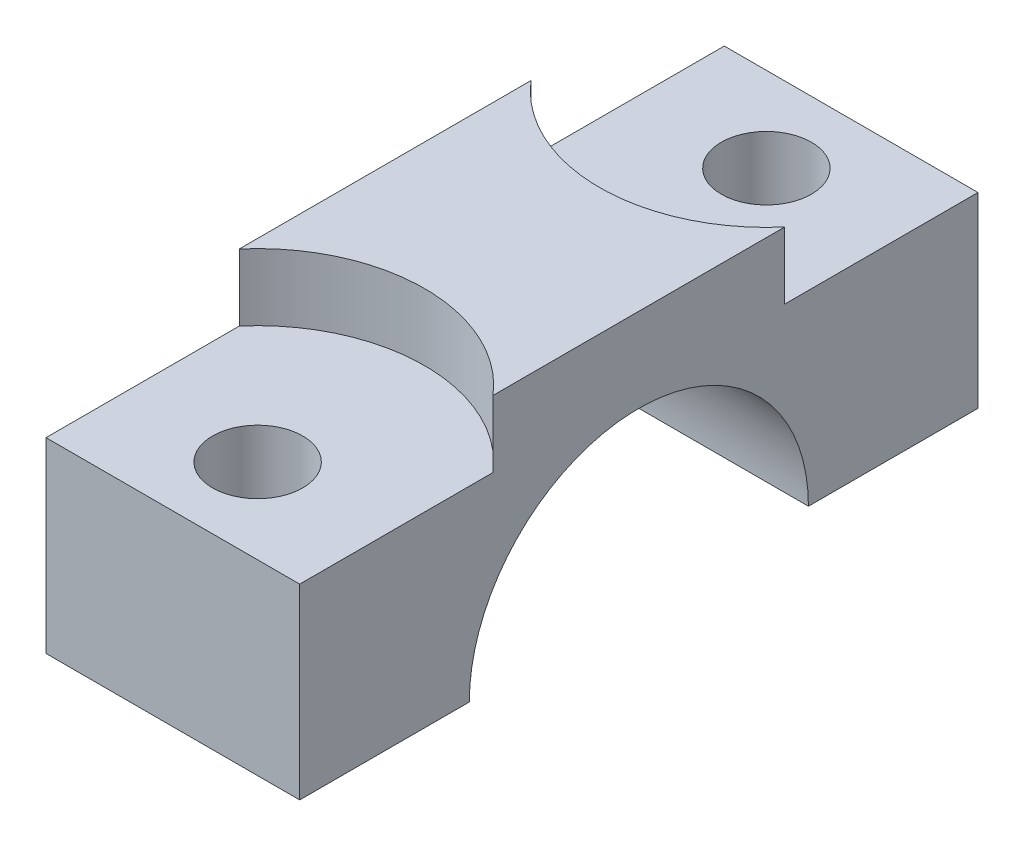
ISO-10303-21;
HEADER;
FILE_DESCRIPTION(('STEP AP214'),'2;1');
FILE_NAME('part.step','',(''),(''),'','','');
FILE_SCHEMA(('AUTOMOTIVE_DESIGN { 1 0 10303 214 1 1 1 1 }'));
ENDSEC;
DATA;
#1=APPLICATION_CONTEXT('core data for automotive mechanical design processes');
#2=APPLICATION_PROTOCOL_DEFINITION('international standard','automotive_design',2000,#1);
#3=PRODUCT_CONTEXT('',#1,'mechanical');
#4=PRODUCT('Part','Part','',(#3));
#5=PRODUCT_RELATED_PRODUCT_CATEGORY('part','',(#4));
#6=PRODUCT_DEFINITION_FORMATION('','',#4);
#7=PRODUCT_DEFINITION_CONTEXT('part definition',#1,'design');
#8=PRODUCT_DEFINITION('design','',#6,#7);
#9=PRODUCT_DEFINITION_SHAPE('','',#8);
#10=(LENGTH_UNIT() NAMED_UNIT(*) SI_UNIT(.MILLI.,.METRE.));
#11=(NAMED_UNIT(*) PLANE_ANGLE_UNIT() SI_UNIT($,.RADIAN.));
#12=(NAMED_UNIT(*) SI_UNIT($,.STERADIAN.) SOLID_ANGLE_UNIT());
#13=UNCERTAINTY_MEASURE_WITH_UNIT(LENGTH_MEASURE(1.E-05),#10,'distance_accuracy_value','');
#14=(GEOMETRIC_REPRESENTATION_CONTEXT(3) GLOBAL_UNCERTAINTY_ASSIGNED_CONTEXT((#13)) GLOBAL_UNIT_ASSIGNED_CONTEXT((#10,
#11,#12)) REPRESENTATION_CONTEXT('',''));
#15=CARTESIAN_POINT('',(0.,0.,0.));
#16=DIRECTION('',(0.,0.,1.));
#17=DIRECTION('',(1.,0.,0.));
#18=AXIS2_PLACEMENT_3D('',#15,#16,#17);
#19=CARTESIAN_POINT('',(9.5,0.,0.));
#20=DIRECTION('',(-1.,0.,0.));
#21=DIRECTION('',(0.,0.,1.));
#22=AXIS2_PLACEMENT_3D('',#19,#20,#21);
#23=CYLINDRICAL_SURFACE('',#22,12.7);
#24=CARTESIAN_POINT('',(-9.5,0.,0.));
#25=DIRECTION('',(1.,0.,0.));
#26=DIRECTION('',(0.,0.,-1.));
#27=AXIS2_PLACEMENT_3D('',#24,#25,#26);
#28=CIRCLE('',#27,12.7);
#29=CARTESIAN_POINT('',(-9.5,0.,-12.7));
#30=VERTEX_POINT('',#29);
#31=CARTESIAN_POINT('',(-9.5,0.,12.7));
#32=VERTEX_POINT('',#31);
#33=EDGE_CURVE('E145',#30,#32,#28,.T.);
#34=ORIENTED_EDGE('',*,*,#33,.F.);
#35=DIRECTION('',(-1.,0.,0.));
#36=VECTOR('',#35,1.);
#37=CARTESIAN_POINT('',(9.5,0.,-12.7));
#38=LINE('',#37,#36);
#39=CARTESIAN_POINT('',(9.5,0.,-12.7));
#40=VERTEX_POINT('',#39);
#41=EDGE_CURVE('E167',#40,#30,#38,.T.);
#42=ORIENTED_EDGE('',*,*,#41,.F.);
#43=CARTESIAN_POINT('',(9.5,0.,0.));
#44=DIRECTION('',(1.,0.,0.));
#45=DIRECTION('',(0.,0.,-1.));
#46=AXIS2_PLACEMENT_3D('',#43,#44,#45);
#47=CIRCLE('',#46,12.7);
#48=CARTESIAN_POINT('',(9.5,0.,12.7));
#49=VERTEX_POINT('',#48);
#50=EDGE_CURVE('E188',#40,#49,#47,.T.);
#51=ORIENTED_EDGE('',*,*,#50,.T.);
#52=DIRECTION('',(-1.,0.,0.));
#53=VECTOR('',#52,1.);
#54=CARTESIAN_POINT('',(9.5,0.,12.7));
#55=LINE('',#54,#53);
#56=EDGE_CURVE('E160',#49,#32,#55,.T.);
#57=ORIENTED_EDGE('',*,*,#56,.T.);
#58=EDGE_LOOP('',(#34,#42,#51,#57));
#59=FACE_BOUND('',#58,.T.);
#60=ADVANCED_FACE('F37',(#59),#23,.F.);
#61=CARTESIAN_POINT('',(9.5,0.,0.));
#62=DIRECTION('',(0.,1.,0.));
#63=DIRECTION('',(0.,0.,1.));
#64=AXIS2_PLACEMENT_3D('',#61,#62,#63);
#65=PLANE('',#64);
#66=CARTESIAN_POINT('',(0.,0.,-19.05));
#67=DIRECTION('',(0.,1.,0.));
#68=DIRECTION('',(0.,0.,1.));
#69=AXIS2_PLACEMENT_3D('',#66,#67,#68);
#70=CIRCLE('',#69,3.375);
#71=CARTESIAN_POINT('',(0.,0.,-15.675));
#72=VERTEX_POINT('',#71);
#73=EDGE_CURVE('E130',#72,#72,#70,.T.);
#74=ORIENTED_EDGE('',*,*,#73,.T.);
#75=EDGE_LOOP('',(#74));
#76=FACE_BOUND('',#75,.T.);
#77=DIRECTION('',(0.,0.,-1.));
#78=VECTOR('',#77,1.);
#79=CARTESIAN_POINT('',(-9.5,0.,0.));
#80=LINE('',#79,#78);
#81=CARTESIAN_POINT('',(-9.5,0.,-25.4));
#82=VERTEX_POINT('',#81);
#83=EDGE_CURVE('E148',#30,#82,#80,.T.);
#84=ORIENTED_EDGE('',*,*,#83,.T.);
#85=DIRECTION('',(-1.,0.,0.));
#86=VECTOR('',#85,1.);
#87=CARTESIAN_POINT('',(9.5,0.,-25.4));
#88=LINE('',#87,#86);
#89=CARTESIAN_POINT('',(9.5,0.,-25.4));
#90=VERTEX_POINT('',#89);
#91=EDGE_CURVE('E164',#90,#82,#88,.T.);
#92=ORIENTED_EDGE('',*,*,#91,.F.);
#93=DIRECTION('',(0.,0.,-1.));
#94=VECTOR('',#93,1.);
#95=CARTESIAN_POINT('',(9.5,0.,0.));
#96=LINE('',#95,#94);
#97=EDGE_CURVE('E141',#40,#90,#96,.T.);
#98=ORIENTED_EDGE('',*,*,#97,.F.);
#99=ORIENTED_EDGE('',*,*,#41,.T.);
#100=EDGE_LOOP('',(#84,#92,#98,#99));
#101=FACE_BOUND('',#100,.T.);
#102=ADVANCED_FACE('F205',(#76,#101),#65,.F.);
#103=CARTESIAN_POINT('',(9.5,0.,-25.4));
#104=DIRECTION('',(0.,0.,1.));
#105=DIRECTION('',(1.,0.,0.));
#106=AXIS2_PLACEMENT_3D('',#103,#104,#105);
#107=PLANE('',#106);
#108=DIRECTION('',(0.,1.,0.));
#109=VECTOR('',#108,1.);
#110=CARTESIAN_POINT('',(-9.5,0.,-25.4));
#111=LINE('',#110,#109);
#112=CARTESIAN_POINT('',(-9.5,14.,-25.4));
#113=VERTEX_POINT('',#112);
#114=EDGE_CURVE('E151',#82,#113,#111,.T.);
#115=ORIENTED_EDGE('',*,*,#114,.T.);
#116=DIRECTION('',(1.,0.,0.));
#117=VECTOR('',#116,1.);
#118=CARTESIAN_POINT('',(9.5,14.,-25.4));
#119=LINE('',#118,#117);
#120=CARTESIAN_POINT('',(9.5,14.,-25.4));
#121=VERTEX_POINT('',#120);
#122=EDGE_CURVE('E129',#113,#121,#119,.T.);
#123=ORIENTED_EDGE('',*,*,#122,.T.);
#124=DIRECTION('',(0.,1.,0.));
#125=VECTOR('',#124,1.);
#126=CARTESIAN_POINT('',(9.5,0.,-25.4));
#127=LINE('',#126,#125);
#128=EDGE_CURVE('E136',#90,#121,#127,.T.);
#129=ORIENTED_EDGE('',*,*,#128,.F.);
#130=ORIENTED_EDGE('',*,*,#91,.T.);
#131=EDGE_LOOP('',(#115,#123,#129,#130));
#132=FACE_BOUND('',#131,.T.);
#133=ADVANCED_FACE('F209',(#132),#107,.F.);
#134=CARTESIAN_POINT('',(9.5,19.,0.));
#135=DIRECTION('',(0.,1.,0.));
#136=DIRECTION('',(0.,0.,1.));
#137=AXIS2_PLACEMENT_3D('',#134,#135,#136);
#138=PLANE('',#137);
#139=CARTESIAN_POINT('',(0.,19.,-19.05));
#140=DIRECTION('',(0.,1.,0.));
#141=DIRECTION('',(0.,0.,1.));
#142=AXIS2_PLACEMENT_3D('',#139,#140,#141);
#143=CIRCLE('',#142,12.5);
#144=CARTESIAN_POINT('',(-9.5,19.,-10.925961595364));
#145=VERTEX_POINT('',#144);
#146=CARTESIAN_POINT('',(9.5,19.,-10.925961595364));
#147=VERTEX_POINT('',#146);
#148=EDGE_CURVE('E111',#145,#147,#143,.T.);
#149=ORIENTED_EDGE('',*,*,#148,.F.);
#150=DIRECTION('',(0.,0.,-1.));
#151=VECTOR('',#150,1.);
#152=CARTESIAN_POINT('',(-9.5,19.,0.));
#153=LINE('',#152,#151);
#154=CARTESIAN_POINT('',(-9.5,19.,10.925961595364));
#155=VERTEX_POINT('',#154);
#156=EDGE_CURVE('E155',#155,#145,#153,.T.);
#157=ORIENTED_EDGE('',*,*,#156,.F.);
#158=CARTESIAN_POINT('',(0.,19.,19.05));
#159=DIRECTION('',(0.,1.,0.));
#160=DIRECTION('',(0.,0.,1.));
#161=AXIS2_PLACEMENT_3D('',#158,#159,#160);
#162=CIRCLE('',#161,12.5);
#163=CARTESIAN_POINT('',(9.5,19.,10.925961595364));
#164=VERTEX_POINT('',#163);
#165=EDGE_CURVE('E134',#164,#155,#162,.T.);
#166=ORIENTED_EDGE('',*,*,#165,.F.);
#167=DIRECTION('',(0.,0.,-1.));
#168=VECTOR('',#167,1.);
#169=CARTESIAN_POINT('',(9.5,19.,0.));
#170=LINE('',#169,#168);
#171=EDGE_CURVE('E126',#164,#147,#170,.T.);
#172=ORIENTED_EDGE('',*,*,#171,.T.);
#173=EDGE_LOOP('',(#149,#157,#166,#172));
#174=FACE_BOUND('',#173,.T.);
#175=ADVANCED_FACE('F133',(#174),#138,.T.);
#176=CARTESIAN_POINT('',(9.5,0.,25.4));
#177=DIRECTION('',(0.,0.,1.));
#178=DIRECTION('',(1.,0.,0.));
#179=AXIS2_PLACEMENT_3D('',#176,#177,#178);
#180=PLANE('',#179);
#181=DIRECTION('',(1.,0.,0.));
#182=VECTOR('',#181,1.);
#183=CARTESIAN_POINT('',(9.5,14.,25.4));
#184=LINE('',#183,#182);
#185=CARTESIAN_POINT('',(-9.5,14.,25.4));
#186=VERTEX_POINT('',#185);
#187=CARTESIAN_POINT('',(9.5,14.,25.4));
#188=VERTEX_POINT('',#187);
#189=EDGE_CURVE('E149',#186,#188,#184,.T.);
#190=ORIENTED_EDGE('',*,*,#189,.F.);
#191=DIRECTION('',(0.,1.,0.));
#192=VECTOR('',#191,1.);
#193=CARTESIAN_POINT('',(-9.5,0.,25.4));
#194=LINE('',#193,#192);
#195=CARTESIAN_POINT('',(-9.5,0.,25.4));
#196=VERTEX_POINT('',#195);
#197=EDGE_CURVE('E157',#196,#186,#194,.T.);
#198=ORIENTED_EDGE('',*,*,#197,.F.);
#199=DIRECTION('',(-1.,0.,0.));
#200=VECTOR('',#199,1.);
#201=CARTESIAN_POINT('',(9.5,0.,25.4));
#202=LINE('',#201,#200);
#203=CARTESIAN_POINT('',(9.5,0.,25.4));
#204=VERTEX_POINT('',#203);
#205=EDGE_CURVE('E162',#204,#196,#202,.T.);
#206=ORIENTED_EDGE('',*,*,#205,.F.);
#207=DIRECTION('',(0.,1.,0.));
#208=VECTOR('',#207,1.);
#209=CARTESIAN_POINT('',(9.5,0.,25.4));
#210=LINE('',#209,#208);
#211=EDGE_CURVE('E135',#204,#188,#210,.T.);
#212=ORIENTED_EDGE('',*,*,#211,.T.);
#213=EDGE_LOOP('',(#190,#198,#206,#212));
#214=FACE_BOUND('',#213,.T.);
#215=ADVANCED_FACE('F250',(#214),#180,.T.);
#216=CARTESIAN_POINT('',(0.,0.,19.05));
#217=DIRECTION('',(0.,1.,0.));
#218=DIRECTION('',(0.,0.,1.));
#219=AXIS2_PLACEMENT_3D('',#216,#217,#218);
#220=CIRCLE('',#219,3.375);
#221=CARTESIAN_POINT('',(0.,0.,22.425));
#222=VERTEX_POINT('',#221);
#223=EDGE_CURVE('E180',#222,#222,#220,.T.);
#224=ORIENTED_EDGE('',*,*,#223,.T.);
#225=EDGE_LOOP('',(#224));
#226=FACE_BOUND('',#225,.T.);
#227=EDGE_CURVE('E152',#196,#32,#80,.T.);
#228=ORIENTED_EDGE('',*,*,#227,.T.);
#229=ORIENTED_EDGE('',*,*,#56,.F.);
#230=EDGE_CURVE('E139',#204,#49,#96,.T.);
#231=ORIENTED_EDGE('',*,*,#230,.F.);
#232=ORIENTED_EDGE('',*,*,#205,.T.);
#233=EDGE_LOOP('',(#228,#229,#231,#232));
#234=FACE_BOUND('',#233,.T.);
#235=ADVANCED_FACE('F199',(#226,#234),#65,.F.);
#236=CARTESIAN_POINT('',(9.5,0.,0.));
#237=DIRECTION('',(1.,0.,0.));
#238=DIRECTION('',(0.,0.,-1.));
#239=AXIS2_PLACEMENT_3D('',#236,#237,#238);
#240=PLANE('',#239);
#241=DIRECTION('',(0.,0.,-1.));
#242=VECTOR('',#241,1.);
#243=CARTESIAN_POINT('',(9.5,14.,0.));
#244=LINE('',#243,#242);
#245=CARTESIAN_POINT('',(9.5,14.,-10.925961595364));
#246=VERTEX_POINT('',#245);
#247=EDGE_CURVE('E128',#246,#121,#244,.T.);
#248=ORIENTED_EDGE('',*,*,#247,.F.);
#249=DIRECTION('',(0.,1.,0.));
#250=VECTOR('',#249,1.);
#251=CARTESIAN_POINT('',(9.5,19.,-10.925961595364));
#252=LINE('',#251,#250);
#253=EDGE_CURVE('E114',#147,#246,#252,.F.);
#254=ORIENTED_EDGE('',*,*,#253,.F.);
#255=ORIENTED_EDGE('',*,*,#171,.F.);
#256=DIRECTION('',(0.,1.,0.));
#257=VECTOR('',#256,1.);
#258=CARTESIAN_POINT('',(9.5,19.,10.925961595364));
#259=LINE('',#258,#257);
#260=CARTESIAN_POINT('',(9.5,14.,10.925961595364));
#261=VERTEX_POINT('',#260);
#262=EDGE_CURVE('E169',#261,#164,#259,.T.);
#263=ORIENTED_EDGE('',*,*,#262,.F.);
#264=DIRECTION('',(0.,0.,-1.));
#265=VECTOR('',#264,1.);
#266=CARTESIAN_POINT('',(9.5,14.,0.));
#267=LINE('',#266,#265);
#268=EDGE_CURVE('E171',#188,#261,#267,.T.);
#269=ORIENTED_EDGE('',*,*,#268,.F.);
#270=ORIENTED_EDGE('',*,*,#211,.F.);
#271=ORIENTED_EDGE('',*,*,#230,.T.);
#272=ORIENTED_EDGE('',*,*,#50,.F.);
#273=ORIENTED_EDGE('',*,*,#97,.T.);
#274=ORIENTED_EDGE('',*,*,#128,.T.);
#275=EDGE_LOOP('',(#248,#254,#255,#263,#269,#270,#271,#272,#273,#274));
#276=FACE_BOUND('',#275,.T.);
#277=ADVANCED_FACE('F124',(#276),#240,.T.);
#278=CARTESIAN_POINT('',(-9.5,0.,0.));
#279=DIRECTION('',(1.,0.,0.));
#280=DIRECTION('',(0.,0.,-1.));
#281=AXIS2_PLACEMENT_3D('',#278,#279,#280);
#282=PLANE('',#281);
#283=DIRECTION('',(0.,1.,0.));
#284=VECTOR('',#283,1.);
#285=CARTESIAN_POINT('',(-9.5,19.,-10.925961595364));
#286=LINE('',#285,#284);
#287=CARTESIAN_POINT('',(-9.5,14.,-10.925961595364));
#288=VERTEX_POINT('',#287);
#289=EDGE_CURVE('E44',#145,#288,#286,.F.);
#290=ORIENTED_EDGE('',*,*,#289,.T.);
#291=DIRECTION('',(0.,0.,-1.));
#292=VECTOR('',#291,1.);
#293=CARTESIAN_POINT('',(-9.5,14.,0.));
#294=LINE('',#293,#292);
#295=EDGE_CURVE('E11',#288,#113,#294,.T.);
#296=ORIENTED_EDGE('',*,*,#295,.T.);
#297=ORIENTED_EDGE('',*,*,#114,.F.);
#298=ORIENTED_EDGE('',*,*,#83,.F.);
#299=ORIENTED_EDGE('',*,*,#33,.T.);
#300=ORIENTED_EDGE('',*,*,#227,.F.);
#301=ORIENTED_EDGE('',*,*,#197,.T.);
#302=DIRECTION('',(0.,0.,-1.));
#303=VECTOR('',#302,1.);
#304=CARTESIAN_POINT('',(-9.5,14.,0.));
#305=LINE('',#304,#303);
#306=CARTESIAN_POINT('',(-9.5,14.,10.925961595364));
#307=VERTEX_POINT('',#306);
#308=EDGE_CURVE('E173',#186,#307,#305,.T.);
#309=ORIENTED_EDGE('',*,*,#308,.T.);
#310=DIRECTION('',(0.,1.,0.));
#311=VECTOR('',#310,1.);
#312=CARTESIAN_POINT('',(-9.5,19.,10.925961595364));
#313=LINE('',#312,#311);
#314=EDGE_CURVE('E179',#307,#155,#313,.T.);
#315=ORIENTED_EDGE('',*,*,#314,.T.);
#316=ORIENTED_EDGE('',*,*,#156,.T.);
#317=EDGE_LOOP('',(#290,#296,#297,#298,#299,#300,#301,#309,#315,#316));
#318=FACE_BOUND('',#317,.T.);
#319=ADVANCED_FACE('F176',(#318),#282,.F.);
#320=CARTESIAN_POINT('',(0.,19.,19.05));
#321=DIRECTION('',(0.,1.,0.));
#322=DIRECTION('',(0.,0.,1.));
#323=AXIS2_PLACEMENT_3D('',#320,#321,#322);
#324=CYLINDRICAL_SURFACE('',#323,12.5);
#325=CARTESIAN_POINT('',(0.,14.,19.05));
#326=DIRECTION('',(0.,1.,0.));
#327=DIRECTION('',(0.,0.,1.));
#328=AXIS2_PLACEMENT_3D('',#325,#326,#327);
#329=CIRCLE('',#328,12.5);
#330=EDGE_CURVE('E59',#261,#307,#329,.T.);
#331=ORIENTED_EDGE('',*,*,#330,.F.);
#332=ORIENTED_EDGE('',*,*,#262,.T.);
#333=ORIENTED_EDGE('',*,*,#165,.T.);
#334=ORIENTED_EDGE('',*,*,#314,.F.);
#335=EDGE_LOOP('',(#331,#332,#333,#334));
#336=FACE_BOUND('',#335,.T.);
#337=ADVANCED_FACE('F233',(#336),#324,.F.);
#338=CARTESIAN_POINT('',(0.,19.,19.05));
#339=DIRECTION('',(0.,1.,0.));
#340=DIRECTION('',(0.,0.,1.));
#341=AXIS2_PLACEMENT_3D('',#338,#339,#340);
#342=CYLINDRICAL_SURFACE('',#341,3.375);
#343=ORIENTED_EDGE('',*,*,#223,.F.);
#344=EDGE_LOOP('',(#343));
#345=FACE_BOUND('',#344,.T.);
#346=CARTESIAN_POINT('',(0.,14.,19.05));
#347=DIRECTION('',(0.,1.,0.));
#348=DIRECTION('',(0.,0.,1.));
#349=AXIS2_PLACEMENT_3D('',#346,#347,#348);
#350=CIRCLE('',#349,3.375);
#351=CARTESIAN_POINT('',(0.,14.,22.425));
#352=VERTEX_POINT('',#351);
#353=EDGE_CURVE('E184',#352,#352,#350,.T.);
#354=ORIENTED_EDGE('',*,*,#353,.T.);
#355=EDGE_LOOP('',(#354));
#356=FACE_BOUND('',#355,.T.);
#357=ADVANCED_FACE('F219',(#345,#356),#342,.F.);
#358=CARTESIAN_POINT('',(3.375,14.,19.05));
#359=DIRECTION('',(0.,-1.,0.));
#360=DIRECTION('',(0.,0.,-1.));
#361=AXIS2_PLACEMENT_3D('',#358,#359,#360);
#362=PLANE('',#361);
#363=ORIENTED_EDGE('',*,*,#268,.T.);
#364=ORIENTED_EDGE('',*,*,#330,.T.);
#365=ORIENTED_EDGE('',*,*,#308,.F.);
#366=ORIENTED_EDGE('',*,*,#189,.T.);
#367=EDGE_LOOP('',(#363,#364,#365,#366));
#368=FACE_BOUND('',#367,.T.);
#369=ORIENTED_EDGE('',*,*,#353,.F.);
#370=EDGE_LOOP('',(#369));
#371=FACE_BOUND('',#370,.T.);
#372=ADVANCED_FACE('F221',(#368,#371),#362,.F.);
#373=CARTESIAN_POINT('',(0.,19.,-19.05));
#374=DIRECTION('',(0.,1.,0.));
#375=DIRECTION('',(0.,0.,1.));
#376=AXIS2_PLACEMENT_3D('',#373,#374,#375);
#377=CYLINDRICAL_SURFACE('',#376,3.375);
#378=ORIENTED_EDGE('',*,*,#73,.F.);
#379=EDGE_LOOP('',(#378));
#380=FACE_BOUND('',#379,.T.);
#381=CARTESIAN_POINT('',(0.,14.,-19.05));
#382=DIRECTION('',(0.,1.,0.));
#383=DIRECTION('',(0.,0.,1.));
#384=AXIS2_PLACEMENT_3D('',#381,#382,#383);
#385=CIRCLE('',#384,3.375);
#386=CARTESIAN_POINT('',(0.,14.,-15.675));
#387=VERTEX_POINT('',#386);
#388=EDGE_CURVE('E348',#387,#387,#385,.T.);
#389=ORIENTED_EDGE('',*,*,#388,.T.);
#390=EDGE_LOOP('',(#389));
#391=FACE_BOUND('',#390,.T.);
#392=ADVANCED_FACE('F223',(#380,#391),#377,.F.);
#393=CARTESIAN_POINT('',(3.375,14.,-19.05));
#394=DIRECTION('',(0.,-1.,0.));
#395=DIRECTION('',(0.,0.,-1.));
#396=AXIS2_PLACEMENT_3D('',#393,#394,#395);
#397=PLANE('',#396);
#398=ORIENTED_EDGE('',*,*,#247,.T.);
#399=ORIENTED_EDGE('',*,*,#122,.F.);
#400=ORIENTED_EDGE('',*,*,#295,.F.);
#401=CARTESIAN_POINT('',(0.,14.,-19.05));
#402=DIRECTION('',(0.,1.,0.));
#403=DIRECTION('',(0.,0.,1.));
#404=AXIS2_PLACEMENT_3D('',#401,#402,#403);
#405=CIRCLE('',#404,12.5);
#406=EDGE_CURVE('E51',#288,#246,#405,.T.);
#407=ORIENTED_EDGE('',*,*,#406,.T.);
#408=EDGE_LOOP('',(#398,#399,#400,#407));
#409=FACE_BOUND('',#408,.T.);
#410=ORIENTED_EDGE('',*,*,#388,.F.);
#411=EDGE_LOOP('',(#410));
#412=FACE_BOUND('',#411,.T.);
#413=ADVANCED_FACE('F230',(#409,#412),#397,.F.);
#414=CARTESIAN_POINT('',(0.,19.,-19.05));
#415=DIRECTION('',(0.,1.,0.));
#416=DIRECTION('',(0.,0.,1.));
#417=AXIS2_PLACEMENT_3D('',#414,#415,#416);
#418=CYLINDRICAL_SURFACE('',#417,12.5);
#419=ORIENTED_EDGE('',*,*,#253,.T.);
#420=ORIENTED_EDGE('',*,*,#406,.F.);
#421=ORIENTED_EDGE('',*,*,#289,.F.);
#422=ORIENTED_EDGE('',*,*,#148,.T.);
#423=EDGE_LOOP('',(#419,#420,#421,#422));
#424=FACE_BOUND('',#423,.T.);
#425=ADVANCED_FACE('F113',(#424),#418,.F.);
#426=CLOSED_SHELL('',(#60,#102,#133,#175,#215,#235,#277,#319,#337,#357,#372,#392,#413,#425));
#427=MANIFOLD_SOLID_BREP('B2',#426);
#428=ADVANCED_BREP_SHAPE_REPRESENTATION('',(#18,#427),#14);
#429=SHAPE_DEFINITION_REPRESENTATION(#9,#428);
ENDSEC;
END-ISO-10303-21;
